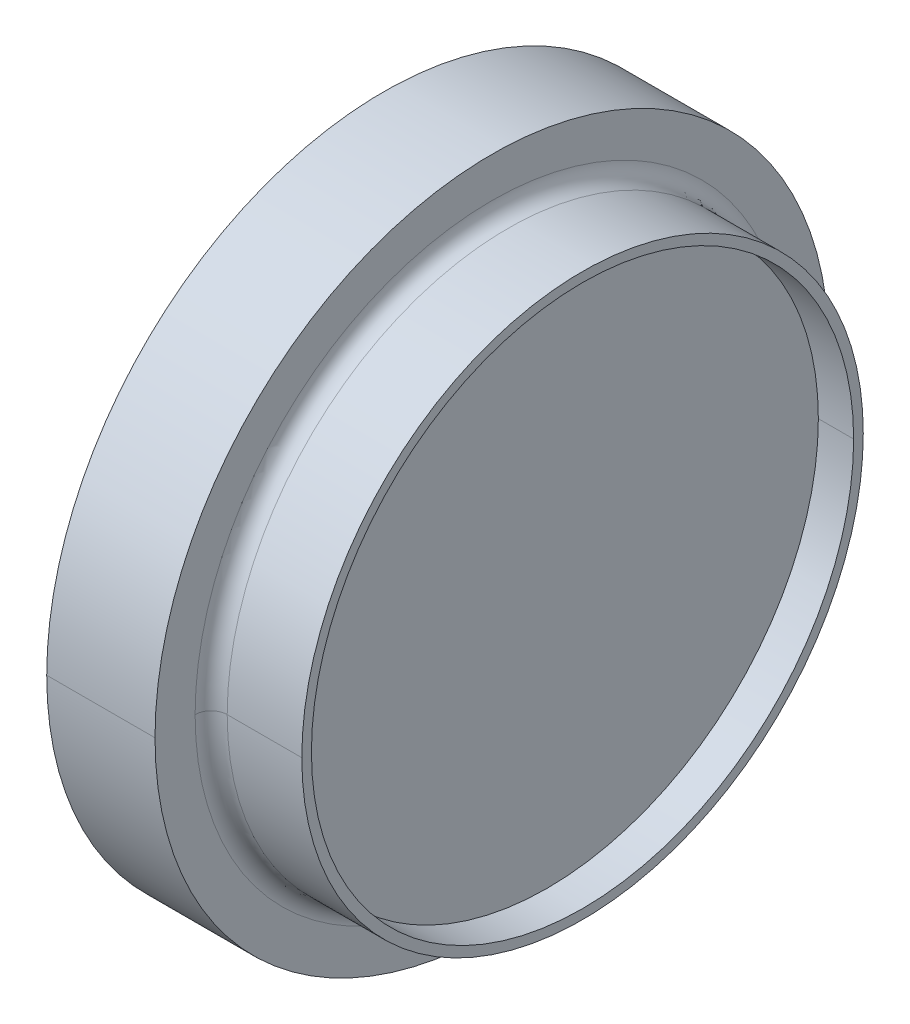
ISO-10303-21;
HEADER;
FILE_DESCRIPTION(('STEP AP214'),'2;1');
FILE_NAME('part.step','',(''),(''),'','','');
FILE_SCHEMA(('AUTOMOTIVE_DESIGN { 1 0 10303 214 1 1 1 1 }'));
ENDSEC;
DATA;
#1=APPLICATION_CONTEXT('core data for automotive mechanical design processes');
#2=APPLICATION_PROTOCOL_DEFINITION('international standard','automotive_design',2000,#1);
#3=PRODUCT_CONTEXT('',#1,'mechanical');
#4=PRODUCT('Part','Part','',(#3));
#5=PRODUCT_RELATED_PRODUCT_CATEGORY('part','',(#4));
#6=PRODUCT_DEFINITION_FORMATION('','',#4);
#7=PRODUCT_DEFINITION_CONTEXT('part definition',#1,'design');
#8=PRODUCT_DEFINITION('design','',#6,#7);
#9=PRODUCT_DEFINITION_SHAPE('','',#8);
#10=(LENGTH_UNIT() NAMED_UNIT(*) SI_UNIT(.MILLI.,.METRE.));
#11=(NAMED_UNIT(*) PLANE_ANGLE_UNIT() SI_UNIT($,.RADIAN.));
#12=(NAMED_UNIT(*) SI_UNIT($,.STERADIAN.) SOLID_ANGLE_UNIT());
#13=UNCERTAINTY_MEASURE_WITH_UNIT(LENGTH_MEASURE(1.E-05),#10,'distance_accuracy_value','');
#14=(GEOMETRIC_REPRESENTATION_CONTEXT(3) GLOBAL_UNCERTAINTY_ASSIGNED_CONTEXT((#13)) GLOBAL_UNIT_ASSIGNED_CONTEXT((#10,
#11,#12)) REPRESENTATION_CONTEXT('',''));
#15=CARTESIAN_POINT('',(0.,0.,0.));
#16=DIRECTION('',(0.,0.,1.));
#17=DIRECTION('',(1.,0.,0.));
#18=AXIS2_PLACEMENT_3D('',#15,#16,#17);
#19=CARTESIAN_POINT('',(85.65,0.,8.45));
#20=DIRECTION('',(1.,0.,0.));
#21=DIRECTION('',(0.,1.,0.));
#22=AXIS2_PLACEMENT_3D('',#19,#20,#21);
#23=PLANE('',#22);
#24=CARTESIAN_POINT('',(85.65,0.,0.));
#25=DIRECTION('',(1.,0.,0.));
#26=DIRECTION('',(0.,0.,1.));
#27=AXIS2_PLACEMENT_3D('',#24,#25,#26);
#28=CIRCLE('',#27,16.9);
#29=CARTESIAN_POINT('',(85.65,0.,16.9));
#30=VERTEX_POINT('',#29);
#31=CARTESIAN_POINT('',(85.65,0.,-16.9));
#32=VERTEX_POINT('',#31);
#33=EDGE_CURVE('E11',#30,#32,#28,.T.);
#34=ORIENTED_EDGE('',*,*,#33,.T.);
#35=CARTESIAN_POINT('',(85.65,0.,0.));
#36=DIRECTION('',(1.,0.,0.));
#37=DIRECTION('',(0.,0.,1.));
#38=AXIS2_PLACEMENT_3D('',#35,#36,#37);
#39=CIRCLE('',#38,16.9);
#40=EDGE_CURVE('E179',#32,#30,#39,.T.);
#41=ORIENTED_EDGE('',*,*,#40,.T.);
#42=EDGE_LOOP('',(#34,#41));
#43=FACE_BOUND('',#42,.T.);
#44=ADVANCED_FACE('F17',(#43),#23,.T.);
#45=CARTESIAN_POINT('',(86.75,0.,0.));
#46=DIRECTION('',(1.,0.,0.));
#47=DIRECTION('',(0.,0.,1.));
#48=AXIS2_PLACEMENT_3D('',#45,#46,#47);
#49=CYLINDRICAL_SURFACE('',#48,16.9);
#50=DIRECTION('',(1.,0.,0.));
#51=VECTOR('',#50,1.);
#52=CARTESIAN_POINT('',(86.75,0.,16.9));
#53=LINE('',#52,#51);
#54=CARTESIAN_POINT('',(87.85,0.,16.9));
#55=VERTEX_POINT('',#54);
#56=EDGE_CURVE('E156',#30,#55,#53,.T.);
#57=ORIENTED_EDGE('',*,*,#56,.T.);
#58=CARTESIAN_POINT('',(87.85,0.,0.));
#59=DIRECTION('',(1.,0.,0.));
#60=DIRECTION('',(0.,0.,1.));
#61=AXIS2_PLACEMENT_3D('',#58,#59,#60);
#62=CIRCLE('',#61,16.9);
#63=CARTESIAN_POINT('',(87.85,0.,-16.9));
#64=VERTEX_POINT('',#63);
#65=EDGE_CURVE('E28',#55,#64,#62,.T.);
#66=ORIENTED_EDGE('',*,*,#65,.T.);
#67=DIRECTION('',(-1.,0.,0.));
#68=VECTOR('',#67,1.);
#69=CARTESIAN_POINT('',(86.75,0.,-16.9));
#70=LINE('',#69,#68);
#71=EDGE_CURVE('E134',#64,#32,#70,.T.);
#72=ORIENTED_EDGE('',*,*,#71,.T.);
#73=ORIENTED_EDGE('',*,*,#33,.F.);
#74=EDGE_LOOP('',(#57,#66,#72,#73));
#75=FACE_BOUND('',#74,.T.);
#76=ADVANCED_FACE('F294',(#75),#49,.F.);
#77=CARTESIAN_POINT('',(87.85,0.,17.2));
#78=DIRECTION('',(1.,0.,0.));
#79=DIRECTION('',(0.,1.,0.));
#80=AXIS2_PLACEMENT_3D('',#77,#78,#79);
#81=PLANE('',#80);
#82=ORIENTED_EDGE('',*,*,#65,.F.);
#83=CARTESIAN_POINT('',(87.85,0.,0.));
#84=DIRECTION('',(1.,0.,0.));
#85=DIRECTION('',(0.,0.,1.));
#86=AXIS2_PLACEMENT_3D('',#83,#84,#85);
#87=CIRCLE('',#86,16.9);
#88=EDGE_CURVE('E125',#64,#55,#87,.T.);
#89=ORIENTED_EDGE('',*,*,#88,.F.);
#90=EDGE_LOOP('',(#82,#89));
#91=FACE_BOUND('',#90,.T.);
#92=CARTESIAN_POINT('',(87.85,0.,0.));
#93=DIRECTION('',(1.,0.,0.));
#94=DIRECTION('',(0.,0.,1.));
#95=AXIS2_PLACEMENT_3D('',#92,#93,#94);
#96=CIRCLE('',#95,17.5);
#97=CARTESIAN_POINT('',(87.85,0.,17.5));
#98=VERTEX_POINT('',#97);
#99=CARTESIAN_POINT('',(87.85,0.,-17.5));
#100=VERTEX_POINT('',#99);
#101=EDGE_CURVE('E21',#98,#100,#96,.T.);
#102=ORIENTED_EDGE('',*,*,#101,.T.);
#103=CARTESIAN_POINT('',(87.85,0.,0.));
#104=DIRECTION('',(1.,0.,0.));
#105=DIRECTION('',(0.,0.,1.));
#106=AXIS2_PLACEMENT_3D('',#103,#104,#105);
#107=CIRCLE('',#106,17.5);
#108=EDGE_CURVE('E105',#100,#98,#107,.T.);
#109=ORIENTED_EDGE('',*,*,#108,.T.);
#110=EDGE_LOOP('',(#102,#109));
#111=FACE_BOUND('',#110,.T.);
#112=ADVANCED_FACE('F107',(#91,#111),#81,.T.);
#113=CARTESIAN_POINT('',(85.525,0.,0.));
#114=DIRECTION('',(1.,0.,0.));
#115=DIRECTION('',(0.,0.,1.));
#116=AXIS2_PLACEMENT_3D('',#113,#114,#115);
#117=CYLINDRICAL_SURFACE('',#116,17.5);
#118=DIRECTION('',(1.,0.,0.));
#119=VECTOR('',#118,1.);
#120=CARTESIAN_POINT('',(85.525,0.,17.5));
#121=LINE('',#120,#119);
#122=CARTESIAN_POINT('',(83.2,0.,17.5));
#123=VERTEX_POINT('',#122);
#124=EDGE_CURVE('E118',#123,#98,#121,.T.);
#125=ORIENTED_EDGE('',*,*,#124,.T.);
#126=ORIENTED_EDGE('',*,*,#108,.F.);
#127=DIRECTION('',(-1.,0.,0.));
#128=VECTOR('',#127,1.);
#129=CARTESIAN_POINT('',(85.525,0.,-17.5));
#130=LINE('',#129,#128);
#131=CARTESIAN_POINT('',(83.2,0.,-17.5));
#132=VERTEX_POINT('',#131);
#133=EDGE_CURVE('E119',#100,#132,#130,.T.);
#134=ORIENTED_EDGE('',*,*,#133,.T.);
#135=CARTESIAN_POINT('',(83.2,0.,0.));
#136=DIRECTION('',(1.,0.,0.));
#137=DIRECTION('',(0.,0.,1.));
#138=AXIS2_PLACEMENT_3D('',#135,#136,#137);
#139=CIRCLE('',#138,17.5);
#140=EDGE_CURVE('E98',#132,#123,#139,.T.);
#141=ORIENTED_EDGE('',*,*,#140,.T.);
#142=EDGE_LOOP('',(#125,#126,#134,#141));
#143=FACE_BOUND('',#142,.T.);
#144=ADVANCED_FACE('F122',(#143),#117,.T.);
#145=CARTESIAN_POINT('',(83.2000000001,0.,0.));
#146=DIRECTION('',(1.,0.,0.));
#147=DIRECTION('',(0.,0.,-1.));
#148=AXIS2_PLACEMENT_3D('',#145,#146,#147);
#149=TOROIDAL_SURFACE('',#148,18.5000000001,1.);
#150=CARTESIAN_POINT('',(83.2000000001,0.,18.5000000001));
#151=DIRECTION('',(0.,-1.,0.));
#152=DIRECTION('',(0.,0.,1.));
#153=AXIS2_PLACEMENT_3D('',#150,#151,#152);
#154=CIRCLE('',#153,1.);
#155=CARTESIAN_POINT('',(82.2000000001,0.,18.5000000000005));
#156=VERTEX_POINT('',#155);
#157=EDGE_CURVE('E121',#156,#123,#154,.T.);
#158=ORIENTED_EDGE('',*,*,#157,.T.);
#159=ORIENTED_EDGE('',*,*,#140,.F.);
#160=CARTESIAN_POINT('',(83.2000000001,0.,-18.5000000001));
#161=DIRECTION('',(0.,-1.,0.));
#162=DIRECTION('',(0.,0.,-1.));
#163=AXIS2_PLACEMENT_3D('',#160,#161,#162);
#164=CIRCLE('',#163,1.);
#165=CARTESIAN_POINT('',(82.2000000001,0.,-18.5000000000005));
#166=VERTEX_POINT('',#165);
#167=EDGE_CURVE('E137',#132,#166,#164,.T.);
#168=ORIENTED_EDGE('',*,*,#167,.T.);
#169=CARTESIAN_POINT('',(82.2000000001,0.,0.));
#170=DIRECTION('',(1.,0.,0.));
#171=DIRECTION('',(0.,0.,1.));
#172=AXIS2_PLACEMENT_3D('',#169,#170,#171);
#173=CIRCLE('',#172,18.5000000000005);
#174=EDGE_CURVE('E172',#166,#156,#173,.T.);
#175=ORIENTED_EDGE('',*,*,#174,.T.);
#176=EDGE_LOOP('',(#158,#159,#168,#175));
#177=FACE_BOUND('',#176,.T.);
#178=ADVANCED_FACE('F233',(#177),#149,.F.);
#179=CARTESIAN_POINT('',(82.20000000005,0.,19.7500000000003));
#180=DIRECTION('',(1.,0.,4.00000033096231E-11));
#181=DIRECTION('',(-4.00000033096231E-11,0.,1.));
#182=AXIS2_PLACEMENT_3D('',#179,#180,#181);
#183=PLANE('',#182);
#184=CARTESIAN_POINT('',(82.2000000001,0.,0.));
#185=DIRECTION('',(1.,0.,0.));
#186=DIRECTION('',(0.,0.,1.));
#187=AXIS2_PLACEMENT_3D('',#184,#185,#186);
#188=CIRCLE('',#187,18.5000000000005);
#189=EDGE_CURVE('E139',#156,#166,#188,.T.);
#190=ORIENTED_EDGE('',*,*,#189,.F.);
#191=ORIENTED_EDGE('',*,*,#174,.F.);
#192=EDGE_LOOP('',(#190,#191));
#193=FACE_BOUND('',#192,.T.);
#194=CARTESIAN_POINT('',(82.2,0.,0.));
#195=DIRECTION('',(1.,0.,0.));
#196=DIRECTION('',(0.,0.,1.));
#197=AXIS2_PLACEMENT_3D('',#194,#195,#196);
#198=CIRCLE('',#197,21.);
#199=CARTESIAN_POINT('',(82.2,0.,21.));
#200=VERTEX_POINT('',#199);
#201=CARTESIAN_POINT('',(82.2,0.,-21.));
#202=VERTEX_POINT('',#201);
#203=EDGE_CURVE('E161',#200,#202,#198,.T.);
#204=ORIENTED_EDGE('',*,*,#203,.T.);
#205=CARTESIAN_POINT('',(82.2,0.,0.));
#206=DIRECTION('',(1.,0.,0.));
#207=DIRECTION('',(0.,0.,1.));
#208=AXIS2_PLACEMENT_3D('',#205,#206,#207);
#209=CIRCLE('',#208,21.);
#210=EDGE_CURVE('E41',#202,#200,#209,.T.);
#211=ORIENTED_EDGE('',*,*,#210,.T.);
#212=EDGE_LOOP('',(#204,#211));
#213=FACE_BOUND('',#212,.T.);
#214=ADVANCED_FACE('F239',(#193,#213),#183,.T.);
#215=CARTESIAN_POINT('',(78.825,0.,0.));
#216=DIRECTION('',(1.,0.,0.));
#217=DIRECTION('',(0.,0.,1.));
#218=AXIS2_PLACEMENT_3D('',#215,#216,#217);
#219=CYLINDRICAL_SURFACE('',#218,21.);
#220=DIRECTION('',(1.,0.,0.));
#221=VECTOR('',#220,1.);
#222=CARTESIAN_POINT('',(78.825,0.,21.));
#223=LINE('',#222,#221);
#224=CARTESIAN_POINT('',(75.45,0.,21.));
#225=VERTEX_POINT('',#224);
#226=EDGE_CURVE('E149',#225,#200,#223,.T.);
#227=ORIENTED_EDGE('',*,*,#226,.T.);
#228=ORIENTED_EDGE('',*,*,#210,.F.);
#229=DIRECTION('',(-1.,0.,0.));
#230=VECTOR('',#229,1.);
#231=CARTESIAN_POINT('',(78.825,0.,-21.));
#232=LINE('',#231,#230);
#233=CARTESIAN_POINT('',(75.45,0.,-21.));
#234=VERTEX_POINT('',#233);
#235=EDGE_CURVE('E158',#202,#234,#232,.T.);
#236=ORIENTED_EDGE('',*,*,#235,.T.);
#237=CARTESIAN_POINT('',(75.45,0.,0.));
#238=DIRECTION('',(1.,0.,0.));
#239=DIRECTION('',(0.,0.,1.));
#240=AXIS2_PLACEMENT_3D('',#237,#238,#239);
#241=CIRCLE('',#240,21.);
#242=EDGE_CURVE('E165',#234,#225,#241,.T.);
#243=ORIENTED_EDGE('',*,*,#242,.T.);
#244=EDGE_LOOP('',(#227,#228,#236,#243));
#245=FACE_BOUND('',#244,.T.);
#246=ADVANCED_FACE('F272',(#245),#219,.T.);
#247=CARTESIAN_POINT('',(75.45,0.,10.5));
#248=DIRECTION('',(-1.,0.,0.));
#249=DIRECTION('',(0.,0.,1.));
#250=AXIS2_PLACEMENT_3D('',#247,#248,#249);
#251=PLANE('',#250);
#252=CARTESIAN_POINT('',(75.45,0.,0.));
#253=DIRECTION('',(1.,0.,0.));
#254=DIRECTION('',(0.,0.,1.));
#255=AXIS2_PLACEMENT_3D('',#252,#253,#254);
#256=CIRCLE('',#255,21.);
#257=EDGE_CURVE('E162',#225,#234,#256,.T.);
#258=ORIENTED_EDGE('',*,*,#257,.F.);
#259=ORIENTED_EDGE('',*,*,#242,.F.);
#260=EDGE_LOOP('',(#258,#259));
#261=FACE_BOUND('',#260,.T.);
#262=ADVANCED_FACE('F19',(#261),#251,.T.);
#263=CARTESIAN_POINT('',(78.825,0.,0.));
#264=DIRECTION('',(1.,0.,0.));
#265=DIRECTION('',(0.,0.,1.));
#266=AXIS2_PLACEMENT_3D('',#263,#264,#265);
#267=CYLINDRICAL_SURFACE('',#266,21.);
#268=ORIENTED_EDGE('',*,*,#226,.F.);
#269=ORIENTED_EDGE('',*,*,#257,.T.);
#270=ORIENTED_EDGE('',*,*,#235,.F.);
#271=ORIENTED_EDGE('',*,*,#203,.F.);
#272=EDGE_LOOP('',(#268,#269,#270,#271));
#273=FACE_BOUND('',#272,.T.);
#274=ADVANCED_FACE('F304',(#273),#267,.T.);
#275=CARTESIAN_POINT('',(83.2000000001,0.,0.));
#276=DIRECTION('',(1.,0.,0.));
#277=DIRECTION('',(0.,0.,-1.));
#278=AXIS2_PLACEMENT_3D('',#275,#276,#277);
#279=TOROIDAL_SURFACE('',#278,18.5000000001,1.);
#280=ORIENTED_EDGE('',*,*,#157,.F.);
#281=ORIENTED_EDGE('',*,*,#189,.T.);
#282=ORIENTED_EDGE('',*,*,#167,.F.);
#283=CARTESIAN_POINT('',(83.2,0.,0.));
#284=DIRECTION('',(1.,0.,0.));
#285=DIRECTION('',(0.,0.,1.));
#286=AXIS2_PLACEMENT_3D('',#283,#284,#285);
#287=CIRCLE('',#286,17.5);
#288=EDGE_CURVE('E124',#123,#132,#287,.T.);
#289=ORIENTED_EDGE('',*,*,#288,.F.);
#290=EDGE_LOOP('',(#280,#281,#282,#289));
#291=FACE_BOUND('',#290,.T.);
#292=ADVANCED_FACE('F283',(#291),#279,.F.);
#293=CARTESIAN_POINT('',(85.525,0.,0.));
#294=DIRECTION('',(1.,0.,0.));
#295=DIRECTION('',(0.,0.,1.));
#296=AXIS2_PLACEMENT_3D('',#293,#294,#295);
#297=CYLINDRICAL_SURFACE('',#296,17.5);
#298=ORIENTED_EDGE('',*,*,#124,.F.);
#299=ORIENTED_EDGE('',*,*,#288,.T.);
#300=ORIENTED_EDGE('',*,*,#133,.F.);
#301=ORIENTED_EDGE('',*,*,#101,.F.);
#302=EDGE_LOOP('',(#298,#299,#300,#301));
#303=FACE_BOUND('',#302,.T.);
#304=ADVANCED_FACE('F116',(#303),#297,.T.);
#305=CARTESIAN_POINT('',(86.75,0.,0.));
#306=DIRECTION('',(1.,0.,0.));
#307=DIRECTION('',(0.,0.,1.));
#308=AXIS2_PLACEMENT_3D('',#305,#306,#307);
#309=CYLINDRICAL_SURFACE('',#308,16.9);
#310=ORIENTED_EDGE('',*,*,#56,.F.);
#311=ORIENTED_EDGE('',*,*,#40,.F.);
#312=ORIENTED_EDGE('',*,*,#71,.F.);
#313=ORIENTED_EDGE('',*,*,#88,.T.);
#314=EDGE_LOOP('',(#310,#311,#312,#313));
#315=FACE_BOUND('',#314,.T.);
#316=ADVANCED_FACE('F257',(#315),#309,.F.);
#317=CLOSED_SHELL('',(#44,#76,#112,#144,#178,#214,#246,#262,#274,#292,#304,#316));
#318=MANIFOLD_SOLID_BREP('B1',#317);
#319=ADVANCED_BREP_SHAPE_REPRESENTATION('',(#18,#318),#14);
#320=SHAPE_DEFINITION_REPRESENTATION(#9,#319);
ENDSEC;
END-ISO-10303-21;
